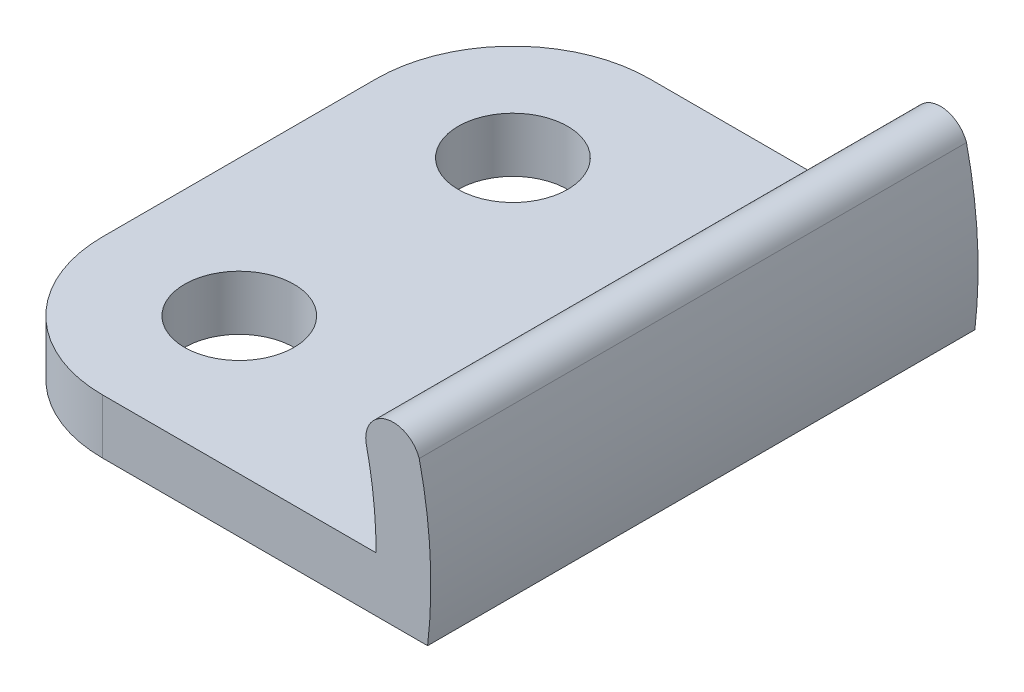
ISO-10303-21;
HEADER;
FILE_DESCRIPTION(('STEP AP214'),'2;1');
FILE_NAME('part.step','',(''),(''),'','','');
FILE_SCHEMA(('AUTOMOTIVE_DESIGN { 1 0 10303 214 1 1 1 1 }'));
ENDSEC;
DATA;
#1=APPLICATION_CONTEXT('core data for automotive mechanical design processes');
#2=APPLICATION_PROTOCOL_DEFINITION('international standard','automotive_design',2000,#1);
#3=PRODUCT_CONTEXT('',#1,'mechanical');
#4=PRODUCT('Part','Part','',(#3));
#5=PRODUCT_RELATED_PRODUCT_CATEGORY('part','',(#4));
#6=PRODUCT_DEFINITION_FORMATION('','',#4);
#7=PRODUCT_DEFINITION_CONTEXT('part definition',#1,'design');
#8=PRODUCT_DEFINITION('design','',#6,#7);
#9=PRODUCT_DEFINITION_SHAPE('','',#8);
#10=(LENGTH_UNIT() NAMED_UNIT(*) SI_UNIT(.MILLI.,.METRE.));
#11=(NAMED_UNIT(*) PLANE_ANGLE_UNIT() SI_UNIT($,.RADIAN.));
#12=(NAMED_UNIT(*) SI_UNIT($,.STERADIAN.) SOLID_ANGLE_UNIT());
#13=UNCERTAINTY_MEASURE_WITH_UNIT(LENGTH_MEASURE(1.E-05),#10,'distance_accuracy_value','');
#14=(GEOMETRIC_REPRESENTATION_CONTEXT(3) GLOBAL_UNCERTAINTY_ASSIGNED_CONTEXT((#13)) GLOBAL_UNIT_ASSIGNED_CONTEXT((#10,
#11,#12)) REPRESENTATION_CONTEXT('',''));
#15=CARTESIAN_POINT('',(0.,0.,0.));
#16=DIRECTION('',(0.,0.,1.));
#17=DIRECTION('',(1.,0.,0.));
#18=AXIS2_PLACEMENT_3D('',#15,#16,#17);
#19=CARTESIAN_POINT('',(15.6268580512046,5.43928042067182,0.));
#20=DIRECTION('',(0.,0.,1.));
#21=DIRECTION('',(1.,0.,0.));
#22=AXIS2_PLACEMENT_3D('',#19,#20,#21);
#23=CYLINDRICAL_SURFACE('',#22,1.00613744918093);
#24=CARTESIAN_POINT('',(15.6268580512046,5.43928042067182,20.));
#25=DIRECTION('',(0.,0.,1.));
#26=DIRECTION('',(1.,0.,0.));
#27=AXIS2_PLACEMENT_3D('',#24,#25,#26);
#28=CIRCLE('',#27,1.00613744918093);
#29=CARTESIAN_POINT('',(16.5759885114296,5.77314257204171,20.));
#30=VERTEX_POINT('',#29);
#31=CARTESIAN_POINT('',(14.6276441346565,5.32144954347464,20.));
#32=VERTEX_POINT('',#31);
#33=EDGE_CURVE('E142',#30,#32,#28,.T.);
#34=ORIENTED_EDGE('',*,*,#33,.F.);
#35=DIRECTION('',(0.,0.,1.));
#36=VECTOR('',#35,1.);
#37=CARTESIAN_POINT('',(16.5759885114296,5.77314257204155,0.));
#38=LINE('',#37,#36);
#39=CARTESIAN_POINT('',(16.5759885114296,5.77314257204171,0.));
#40=VERTEX_POINT('',#39);
#41=EDGE_CURVE('E113',#40,#30,#38,.T.);
#42=ORIENTED_EDGE('',*,*,#41,.F.);
#43=CARTESIAN_POINT('',(15.6268580512046,5.43928042067182,0.));
#44=DIRECTION('',(0.,0.,1.));
#45=DIRECTION('',(1.,0.,0.));
#46=AXIS2_PLACEMENT_3D('',#43,#44,#45);
#47=CIRCLE('',#46,1.00613744918093);
#48=CARTESIAN_POINT('',(14.6276441346566,5.32144954347459,0.));
#49=VERTEX_POINT('',#48);
#50=EDGE_CURVE('E88',#40,#49,#47,.T.);
#51=ORIENTED_EDGE('',*,*,#50,.T.);
#52=DIRECTION('',(0.,0.,1.));
#53=VECTOR('',#52,1.);
#54=CARTESIAN_POINT('',(14.6276441346565,5.32144954347478,0.));
#55=LINE('',#54,#53);
#56=EDGE_CURVE('E111',#49,#32,#55,.T.);
#57=ORIENTED_EDGE('',*,*,#56,.T.);
#58=EDGE_LOOP('',(#34,#42,#51,#57));
#59=FACE_BOUND('',#58,.T.);
#60=ADVANCED_FACE('F16',(#59),#23,.T.);
#61=CARTESIAN_POINT('',(0.,2.,0.));
#62=DIRECTION('',(0.,0.,1.));
#63=DIRECTION('',(1.,0.,0.));
#64=AXIS2_PLACEMENT_3D('',#61,#62,#63);
#65=CYLINDRICAL_SURFACE('',#64,15.);
#66=DIRECTION('',(0.,0.,1.));
#67=VECTOR('',#66,1.);
#68=CARTESIAN_POINT('',(15.,2.,0.));
#69=LINE('',#68,#67);
#70=CARTESIAN_POINT('',(15.,2.,20.));
#71=VERTEX_POINT('',#70);
#72=CARTESIAN_POINT('',(15.,2.,0.));
#73=VERTEX_POINT('',#72);
#74=EDGE_CURVE('E89',#71,#73,#69,.F.);
#75=ORIENTED_EDGE('',*,*,#74,.F.);
#76=CARTESIAN_POINT('',(0.,2.,20.));
#77=DIRECTION('',(0.,0.,1.));
#78=DIRECTION('',(1.,0.,0.));
#79=AXIS2_PLACEMENT_3D('',#76,#77,#78);
#80=CIRCLE('',#79,15.);
#81=EDGE_CURVE('E139',#32,#71,#80,.F.);
#82=ORIENTED_EDGE('',*,*,#81,.F.);
#83=ORIENTED_EDGE('',*,*,#56,.F.);
#84=CARTESIAN_POINT('',(0.,2.,0.));
#85=DIRECTION('',(0.,0.,1.));
#86=DIRECTION('',(1.,0.,0.));
#87=AXIS2_PLACEMENT_3D('',#84,#85,#86);
#88=CIRCLE('',#87,15.);
#89=EDGE_CURVE('E149',#49,#73,#88,.F.);
#90=ORIENTED_EDGE('',*,*,#89,.T.);
#91=EDGE_LOOP('',(#75,#82,#83,#90));
#92=FACE_BOUND('',#91,.T.);
#93=ADVANCED_FACE('F158',(#92),#65,.F.);
#94=CARTESIAN_POINT('',(15.,2.,0.));
#95=DIRECTION('',(0.,1.,0.));
#96=DIRECTION('',(0.,0.,1.));
#97=AXIS2_PLACEMENT_3D('',#94,#95,#96);
#98=PLANE('',#97);
#99=CARTESIAN_POINT('',(5.,2.,15.));
#100=DIRECTION('',(0.,1.,0.));
#101=DIRECTION('',(0.,0.,1.));
#102=AXIS2_PLACEMENT_3D('',#99,#100,#101);
#103=CIRCLE('',#102,2.);
#104=CARTESIAN_POINT('',(5.,2.,17.));
#105=VERTEX_POINT('',#104);
#106=EDGE_CURVE('E103',#105,#105,#103,.F.);
#107=ORIENTED_EDGE('',*,*,#106,.T.);
#108=EDGE_LOOP('',(#107));
#109=FACE_BOUND('',#108,.T.);
#110=CARTESIAN_POINT('',(5.,2.,5.));
#111=DIRECTION('',(0.,1.,0.));
#112=DIRECTION('',(0.,0.,1.));
#113=AXIS2_PLACEMENT_3D('',#110,#111,#112);
#114=CIRCLE('',#113,2.);
#115=CARTESIAN_POINT('',(5.,2.,7.));
#116=VERTEX_POINT('',#115);
#117=EDGE_CURVE('E100',#116,#116,#114,.F.);
#118=ORIENTED_EDGE('',*,*,#117,.T.);
#119=EDGE_LOOP('',(#118));
#120=FACE_BOUND('',#119,.T.);
#121=ORIENTED_EDGE('',*,*,#74,.T.);
#122=DIRECTION('',(1.,0.,0.));
#123=VECTOR('',#122,1.);
#124=CARTESIAN_POINT('',(9.31381759573851,2.,0.));
#125=LINE('',#124,#123);
#126=CARTESIAN_POINT('',(5.,2.,0.));
#127=VERTEX_POINT('',#126);
#128=EDGE_CURVE('E85',#73,#127,#125,.F.);
#129=ORIENTED_EDGE('',*,*,#128,.T.);
#130=CARTESIAN_POINT('',(5.,2.,5.));
#131=DIRECTION('',(0.,1.,0.));
#132=DIRECTION('',(0.,0.,1.));
#133=AXIS2_PLACEMENT_3D('',#130,#131,#132);
#134=CIRCLE('',#133,5.);
#135=CARTESIAN_POINT('',(0.,2.,5.));
#136=VERTEX_POINT('',#135);
#137=EDGE_CURVE('E19',#136,#127,#134,.F.);
#138=ORIENTED_EDGE('',*,*,#137,.F.);
#139=DIRECTION('',(0.,0.,1.));
#140=VECTOR('',#139,1.);
#141=CARTESIAN_POINT('',(0.,2.,0.));
#142=LINE('',#141,#140);
#143=CARTESIAN_POINT('',(0.,2.,15.));
#144=VERTEX_POINT('',#143);
#145=EDGE_CURVE('E83',#144,#136,#142,.F.);
#146=ORIENTED_EDGE('',*,*,#145,.F.);
#147=CARTESIAN_POINT('',(5.,2.,15.));
#148=DIRECTION('',(0.,1.,0.));
#149=DIRECTION('',(0.,0.,1.));
#150=AXIS2_PLACEMENT_3D('',#147,#148,#149);
#151=CIRCLE('',#150,5.);
#152=CARTESIAN_POINT('',(5.,2.,20.));
#153=VERTEX_POINT('',#152);
#154=EDGE_CURVE('E136',#153,#144,#151,.F.);
#155=ORIENTED_EDGE('',*,*,#154,.F.);
#156=DIRECTION('',(1.,0.,0.));
#157=VECTOR('',#156,1.);
#158=CARTESIAN_POINT('',(9.31381759573851,2.,20.));
#159=LINE('',#158,#157);
#160=EDGE_CURVE('E138',#71,#153,#159,.F.);
#161=ORIENTED_EDGE('',*,*,#160,.F.);
#162=EDGE_LOOP('',(#121,#129,#138,#146,#155,#161));
#163=FACE_BOUND('',#162,.T.);
#164=ADVANCED_FACE('F81',(#109,#120,#163),#98,.T.);
#165=CARTESIAN_POINT('',(5.,0.,5.));
#166=DIRECTION('',(0.,1.,0.));
#167=DIRECTION('',(0.,0.,1.));
#168=AXIS2_PLACEMENT_3D('',#165,#166,#167);
#169=CYLINDRICAL_SURFACE('',#168,5.);
#170=CARTESIAN_POINT('',(5.,0.,5.));
#171=DIRECTION('',(0.,1.,0.));
#172=DIRECTION('',(0.,0.,1.));
#173=AXIS2_PLACEMENT_3D('',#170,#171,#172);
#174=CIRCLE('',#173,5.);
#175=CARTESIAN_POINT('',(0.,0.,5.));
#176=VERTEX_POINT('',#175);
#177=CARTESIAN_POINT('',(5.,0.,0.));
#178=VERTEX_POINT('',#177);
#179=EDGE_CURVE('E94',#176,#178,#174,.F.);
#180=ORIENTED_EDGE('',*,*,#179,.F.);
#181=DIRECTION('',(0.,1.,0.));
#182=VECTOR('',#181,1.);
#183=CARTESIAN_POINT('',(0.,2.,5.));
#184=LINE('',#183,#182);
#185=EDGE_CURVE('E91',#136,#176,#184,.F.);
#186=ORIENTED_EDGE('',*,*,#185,.F.);
#187=ORIENTED_EDGE('',*,*,#137,.T.);
#188=DIRECTION('',(0.,1.,0.));
#189=VECTOR('',#188,1.);
#190=CARTESIAN_POINT('',(5.,1.56643939883788,0.));
#191=LINE('',#190,#189);
#192=EDGE_CURVE('E108',#127,#178,#191,.F.);
#193=ORIENTED_EDGE('',*,*,#192,.T.);
#194=EDGE_LOOP('',(#180,#186,#187,#193));
#195=FACE_BOUND('',#194,.T.);
#196=ADVANCED_FACE('F92',(#195),#169,.T.);
#197=CARTESIAN_POINT('',(9.31381759573851,1.56643939883788,0.));
#198=DIRECTION('',(0.,0.,1.));
#199=DIRECTION('',(1.,0.,0.));
#200=AXIS2_PLACEMENT_3D('',#197,#198,#199);
#201=PLANE('',#200);
#202=ORIENTED_EDGE('',*,*,#128,.F.);
#203=ORIENTED_EDGE('',*,*,#89,.F.);
#204=ORIENTED_EDGE('',*,*,#50,.F.);
#205=CARTESIAN_POINT('',(0.,2.,0.));
#206=DIRECTION('',(0.,0.,1.));
#207=DIRECTION('',(1.,0.,0.));
#208=AXIS2_PLACEMENT_3D('',#205,#206,#207);
#209=CIRCLE('',#208,17.);
#210=CARTESIAN_POINT('',(16.8819430161341,0.,0.));
#211=VERTEX_POINT('',#210);
#212=EDGE_CURVE('E115',#211,#40,#209,.T.);
#213=ORIENTED_EDGE('',*,*,#212,.F.);
#214=DIRECTION('',(1.,0.,0.));
#215=VECTOR('',#214,1.);
#216=CARTESIAN_POINT('',(0.,0.,0.));
#217=LINE('',#216,#215);
#218=EDGE_CURVE('E129',#178,#211,#217,.T.);
#219=ORIENTED_EDGE('',*,*,#218,.F.);
#220=ORIENTED_EDGE('',*,*,#192,.F.);
#221=EDGE_LOOP('',(#202,#203,#204,#213,#219,#220));
#222=FACE_BOUND('',#221,.T.);
#223=ADVANCED_FACE('F159',(#222),#201,.F.);
#224=CARTESIAN_POINT('',(0.,2.,0.));
#225=DIRECTION('',(0.,0.,1.));
#226=DIRECTION('',(1.,0.,0.));
#227=AXIS2_PLACEMENT_3D('',#224,#225,#226);
#228=CYLINDRICAL_SURFACE('',#227,17.);
#229=CARTESIAN_POINT('',(0.,2.,20.));
#230=DIRECTION('',(0.,0.,1.));
#231=DIRECTION('',(1.,0.,0.));
#232=AXIS2_PLACEMENT_3D('',#229,#230,#231);
#233=CIRCLE('',#232,17.);
#234=CARTESIAN_POINT('',(16.8819430161341,0.,20.));
#235=VERTEX_POINT('',#234);
#236=EDGE_CURVE('E114',#235,#30,#233,.T.);
#237=ORIENTED_EDGE('',*,*,#236,.F.);
#238=DIRECTION('',(0.,0.,-1.));
#239=VECTOR('',#238,1.);
#240=CARTESIAN_POINT('',(16.8819430161341,0.,0.));
#241=LINE('',#240,#239);
#242=EDGE_CURVE('E162',#211,#235,#241,.F.);
#243=ORIENTED_EDGE('',*,*,#242,.F.);
#244=ORIENTED_EDGE('',*,*,#212,.T.);
#245=ORIENTED_EDGE('',*,*,#41,.T.);
#246=EDGE_LOOP('',(#237,#243,#244,#245));
#247=FACE_BOUND('',#246,.T.);
#248=ADVANCED_FACE('F182',(#247),#228,.T.);
#249=CARTESIAN_POINT('',(9.31381759573851,1.56643939883788,20.));
#250=DIRECTION('',(0.,0.,1.));
#251=DIRECTION('',(1.,0.,0.));
#252=AXIS2_PLACEMENT_3D('',#249,#250,#251);
#253=PLANE('',#252);
#254=ORIENTED_EDGE('',*,*,#81,.T.);
#255=ORIENTED_EDGE('',*,*,#160,.T.);
#256=DIRECTION('',(0.,1.,0.));
#257=VECTOR('',#256,1.);
#258=CARTESIAN_POINT('',(5.,0.,20.));
#259=LINE('',#258,#257);
#260=CARTESIAN_POINT('',(5.,0.,20.));
#261=VERTEX_POINT('',#260);
#262=EDGE_CURVE('E97',#261,#153,#259,.T.);
#263=ORIENTED_EDGE('',*,*,#262,.F.);
#264=DIRECTION('',(1.,0.,0.));
#265=VECTOR('',#264,1.);
#266=CARTESIAN_POINT('',(0.,0.,20.));
#267=LINE('',#266,#265);
#268=EDGE_CURVE('E127',#235,#261,#267,.F.);
#269=ORIENTED_EDGE('',*,*,#268,.F.);
#270=ORIENTED_EDGE('',*,*,#236,.T.);
#271=ORIENTED_EDGE('',*,*,#33,.T.);
#272=EDGE_LOOP('',(#254,#255,#263,#269,#270,#271));
#273=FACE_BOUND('',#272,.T.);
#274=ADVANCED_FACE('F178',(#273),#253,.T.);
#275=CARTESIAN_POINT('',(5.,0.,15.));
#276=DIRECTION('',(0.,1.,0.));
#277=DIRECTION('',(0.,0.,1.));
#278=AXIS2_PLACEMENT_3D('',#275,#276,#277);
#279=CYLINDRICAL_SURFACE('',#278,5.);
#280=CARTESIAN_POINT('',(5.,0.,15.));
#281=DIRECTION('',(0.,1.,0.));
#282=DIRECTION('',(0.,0.,1.));
#283=AXIS2_PLACEMENT_3D('',#280,#281,#282);
#284=CIRCLE('',#283,5.);
#285=CARTESIAN_POINT('',(0.,0.,15.));
#286=VERTEX_POINT('',#285);
#287=EDGE_CURVE('E124',#261,#286,#284,.F.);
#288=ORIENTED_EDGE('',*,*,#287,.F.);
#289=ORIENTED_EDGE('',*,*,#262,.T.);
#290=ORIENTED_EDGE('',*,*,#154,.T.);
#291=DIRECTION('',(0.,1.,0.));
#292=VECTOR('',#291,1.);
#293=CARTESIAN_POINT('',(0.,2.,15.));
#294=LINE('',#293,#292);
#295=EDGE_CURVE('E34',#286,#144,#294,.T.);
#296=ORIENTED_EDGE('',*,*,#295,.F.);
#297=EDGE_LOOP('',(#288,#289,#290,#296));
#298=FACE_BOUND('',#297,.T.);
#299=ADVANCED_FACE('F176',(#298),#279,.T.);
#300=CARTESIAN_POINT('',(0.,2.,0.));
#301=DIRECTION('',(-1.,0.,0.));
#302=DIRECTION('',(0.,0.,1.));
#303=AXIS2_PLACEMENT_3D('',#300,#301,#302);
#304=PLANE('',#303);
#305=ORIENTED_EDGE('',*,*,#295,.T.);
#306=ORIENTED_EDGE('',*,*,#145,.T.);
#307=ORIENTED_EDGE('',*,*,#185,.T.);
#308=DIRECTION('',(0.,0.,-1.));
#309=VECTOR('',#308,1.);
#310=CARTESIAN_POINT('',(0.,0.,0.));
#311=LINE('',#310,#309);
#312=EDGE_CURVE('E121',#286,#176,#311,.T.);
#313=ORIENTED_EDGE('',*,*,#312,.F.);
#314=EDGE_LOOP('',(#305,#306,#307,#313));
#315=FACE_BOUND('',#314,.T.);
#316=ADVANCED_FACE('F99',(#315),#304,.T.);
#317=CARTESIAN_POINT('',(5.,-25.028566582729,5.));
#318=DIRECTION('',(0.,1.,0.));
#319=DIRECTION('',(0.,0.,1.));
#320=AXIS2_PLACEMENT_3D('',#317,#318,#319);
#321=CYLINDRICAL_SURFACE('',#320,2.);
#322=ORIENTED_EDGE('',*,*,#117,.F.);
#323=EDGE_LOOP('',(#322));
#324=FACE_BOUND('',#323,.T.);
#325=CARTESIAN_POINT('',(5.,0.,5.));
#326=DIRECTION('',(0.,1.,0.));
#327=DIRECTION('',(0.,0.,1.));
#328=AXIS2_PLACEMENT_3D('',#325,#326,#327);
#329=CIRCLE('',#328,2.);
#330=CARTESIAN_POINT('',(5.,0.,7.));
#331=VERTEX_POINT('',#330);
#332=EDGE_CURVE('E25',#331,#331,#329,.T.);
#333=ORIENTED_EDGE('',*,*,#332,.F.);
#334=EDGE_LOOP('',(#333));
#335=FACE_BOUND('',#334,.T.);
#336=ADVANCED_FACE('F199',(#324,#335),#321,.F.);
#337=CARTESIAN_POINT('',(5.,-25.028566582729,15.));
#338=DIRECTION('',(0.,1.,0.));
#339=DIRECTION('',(0.,0.,1.));
#340=AXIS2_PLACEMENT_3D('',#337,#338,#339);
#341=CYLINDRICAL_SURFACE('',#340,2.);
#342=ORIENTED_EDGE('',*,*,#106,.F.);
#343=EDGE_LOOP('',(#342));
#344=FACE_BOUND('',#343,.T.);
#345=CARTESIAN_POINT('',(5.,0.,15.));
#346=DIRECTION('',(0.,1.,0.));
#347=DIRECTION('',(0.,0.,1.));
#348=AXIS2_PLACEMENT_3D('',#345,#346,#347);
#349=CIRCLE('',#348,2.);
#350=CARTESIAN_POINT('',(5.,0.,17.));
#351=VERTEX_POINT('',#350);
#352=EDGE_CURVE('E11',#351,#351,#349,.T.);
#353=ORIENTED_EDGE('',*,*,#352,.F.);
#354=EDGE_LOOP('',(#353));
#355=FACE_BOUND('',#354,.T.);
#356=ADVANCED_FACE('F193',(#344,#355),#341,.F.);
#357=CARTESIAN_POINT('',(0.,0.,0.));
#358=DIRECTION('',(0.,-1.,0.));
#359=DIRECTION('',(0.,0.,-1.));
#360=AXIS2_PLACEMENT_3D('',#357,#358,#359);
#361=PLANE('',#360);
#362=ORIENTED_EDGE('',*,*,#352,.T.);
#363=EDGE_LOOP('',(#362));
#364=FACE_BOUND('',#363,.T.);
#365=ORIENTED_EDGE('',*,*,#332,.T.);
#366=EDGE_LOOP('',(#365));
#367=FACE_BOUND('',#366,.T.);
#368=ORIENTED_EDGE('',*,*,#287,.T.);
#369=ORIENTED_EDGE('',*,*,#312,.T.);
#370=ORIENTED_EDGE('',*,*,#179,.T.);
#371=ORIENTED_EDGE('',*,*,#218,.T.);
#372=ORIENTED_EDGE('',*,*,#242,.T.);
#373=ORIENTED_EDGE('',*,*,#268,.T.);
#374=EDGE_LOOP('',(#368,#369,#370,#371,#372,#373));
#375=FACE_BOUND('',#374,.T.);
#376=ADVANCED_FACE('F174',(#364,#367,#375),#361,.T.);
#377=CLOSED_SHELL('',(#60,#93,#164,#196,#223,#248,#274,#299,#316,#336,#356,#376));
#378=MANIFOLD_SOLID_BREP('B1',#377);
#379=ADVANCED_BREP_SHAPE_REPRESENTATION('',(#18,#378),#14);
#380=SHAPE_DEFINITION_REPRESENTATION(#9,#379);
ENDSEC;
END-ISO-10303-21;
